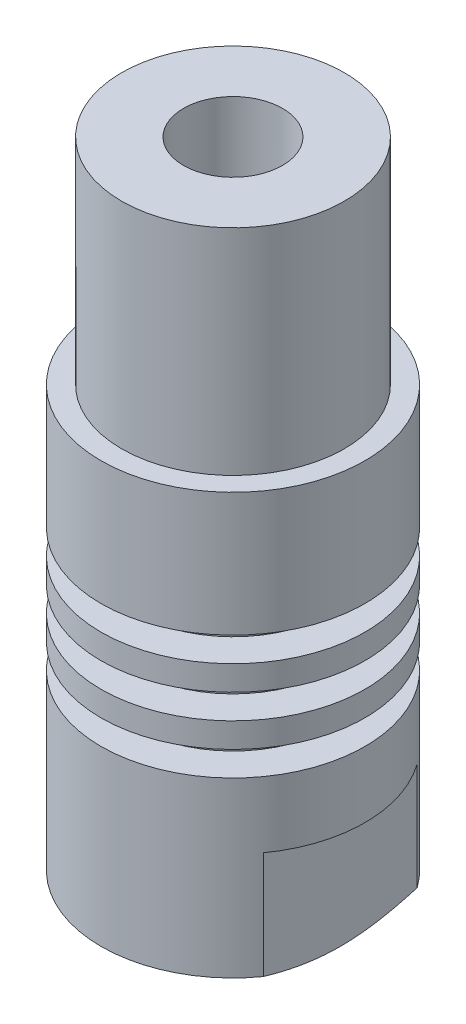
ISO-10303-21;
HEADER;
FILE_DESCRIPTION(('STEP AP214'),'2;1');
FILE_NAME('part.step','',(''),(''),'','','');
FILE_SCHEMA(('AUTOMOTIVE_DESIGN { 1 0 10303 214 1 1 1 1 }'));
ENDSEC;
DATA;
#1=APPLICATION_CONTEXT('core data for automotive mechanical design processes');
#2=APPLICATION_PROTOCOL_DEFINITION('international standard','automotive_design',2000,#1);
#3=PRODUCT_CONTEXT('',#1,'mechanical');
#4=PRODUCT('Part','Part','',(#3));
#5=PRODUCT_RELATED_PRODUCT_CATEGORY('part','',(#4));
#6=PRODUCT_DEFINITION_FORMATION('','',#4);
#7=PRODUCT_DEFINITION_CONTEXT('part definition',#1,'design');
#8=PRODUCT_DEFINITION('design','',#6,#7);
#9=PRODUCT_DEFINITION_SHAPE('','',#8);
#10=(LENGTH_UNIT() NAMED_UNIT(*) SI_UNIT(.MILLI.,.METRE.));
#11=(NAMED_UNIT(*) PLANE_ANGLE_UNIT() SI_UNIT($,.RADIAN.));
#12=(NAMED_UNIT(*) SI_UNIT($,.STERADIAN.) SOLID_ANGLE_UNIT());
#13=UNCERTAINTY_MEASURE_WITH_UNIT(LENGTH_MEASURE(1.E-05),#10,'distance_accuracy_value','');
#14=(GEOMETRIC_REPRESENTATION_CONTEXT(3) GLOBAL_UNCERTAINTY_ASSIGNED_CONTEXT((#13)) GLOBAL_UNIT_ASSIGNED_CONTEXT((#10,
#11,#12)) REPRESENTATION_CONTEXT('',''));
#15=CARTESIAN_POINT('',(0.,0.,0.));
#16=DIRECTION('',(0.,0.,1.));
#17=DIRECTION('',(1.,0.,0.));
#18=AXIS2_PLACEMENT_3D('',#15,#16,#17);
#19=CARTESIAN_POINT('',(0.,129.407380346339,0.));
#20=DIRECTION('',(0.,1.,0.));
#21=DIRECTION('',(0.,0.,1.));
#22=AXIS2_PLACEMENT_3D('',#19,#20,#21);
#23=CYLINDRICAL_SURFACE('',#22,7.99999999999999);
#24=CARTESIAN_POINT('',(0.,19.5,0.));
#25=DIRECTION('',(0.,1.,0.));
#26=DIRECTION('',(0.,0.,1.));
#27=AXIS2_PLACEMENT_3D('',#24,#25,#26);
#28=CIRCLE('',#27,8.);
#29=CARTESIAN_POINT('',(0.,19.5,8.));
#30=VERTEX_POINT('',#29);
#31=EDGE_CURVE('E406',#30,#30,#28,.T.);
#32=ORIENTED_EDGE('',*,*,#31,.T.);
#33=EDGE_LOOP('',(#32));
#34=FACE_BOUND('',#33,.T.);
#35=CARTESIAN_POINT('',(0.,27.,0.));
#36=DIRECTION('',(0.,1.,0.));
#37=DIRECTION('',(0.,0.,1.));
#38=AXIS2_PLACEMENT_3D('',#35,#36,#37);
#39=CIRCLE('',#38,7.99999999999999);
#40=CARTESIAN_POINT('',(0.,27.,7.99999999999999));
#41=VERTEX_POINT('',#40);
#42=EDGE_CURVE('E40',#41,#41,#39,.F.);
#43=ORIENTED_EDGE('',*,*,#42,.T.);
#44=EDGE_LOOP('',(#43));
#45=FACE_BOUND('',#44,.T.);
#46=ADVANCED_FACE('F36',(#34,#45),#23,.T.);
#47=CARTESIAN_POINT('',(-7.99999999999998,40.,0.));
#48=DIRECTION('',(0.,1.,0.));
#49=DIRECTION('',(0.,0.,1.));
#50=AXIS2_PLACEMENT_3D('',#47,#48,#49);
#51=PLANE('',#50);
#52=CARTESIAN_POINT('',(0.,40.,0.));
#53=DIRECTION('',(0.,1.,0.));
#54=DIRECTION('',(0.,0.,1.));
#55=AXIS2_PLACEMENT_3D('',#52,#53,#54);
#56=CIRCLE('',#55,3.);
#57=CARTESIAN_POINT('',(0.,40.,3.));
#58=VERTEX_POINT('',#57);
#59=EDGE_CURVE('E96',#58,#58,#56,.T.);
#60=ORIENTED_EDGE('',*,*,#59,.F.);
#61=EDGE_LOOP('',(#60));
#62=FACE_BOUND('',#61,.T.);
#63=CARTESIAN_POINT('',(0.,40.,0.));
#64=DIRECTION('',(0.,1.,0.));
#65=DIRECTION('',(0.,0.,1.));
#66=AXIS2_PLACEMENT_3D('',#63,#64,#65);
#67=CIRCLE('',#66,6.75);
#68=CARTESIAN_POINT('',(0.,40.,6.75));
#69=VERTEX_POINT('',#68);
#70=EDGE_CURVE('E245',#69,#69,#67,.T.);
#71=ORIENTED_EDGE('',*,*,#70,.T.);
#72=EDGE_LOOP('',(#71));
#73=FACE_BOUND('',#72,.T.);
#74=ADVANCED_FACE('F158',(#62,#73),#51,.T.);
#75=CARTESIAN_POINT('',(0.,1.5,0.));
#76=DIRECTION('',(0.,1.,0.));
#77=DIRECTION('',(0.,0.,1.));
#78=AXIS2_PLACEMENT_3D('',#75,#76,#77);
#79=CONICAL_SURFACE('',#78,7.99999999999999,1.10714871779409);
#80=CARTESIAN_POINT('',(0.,0.,0.));
#81=DIRECTION('',(0.,1.,0.));
#82=DIRECTION('',(0.,0.,1.));
#83=AXIS2_PLACEMENT_3D('',#80,#81,#82);
#84=CIRCLE('',#83,4.99999999999998);
#85=CARTESIAN_POINT('',(0.,0.,4.99999999999998));
#86=VERTEX_POINT('',#85);
#87=EDGE_CURVE('E12',#86,#86,#84,.T.);
#88=ORIENTED_EDGE('',*,*,#87,.T.);
#89=EDGE_LOOP('',(#88));
#90=FACE_BOUND('',#89,.T.);
#91=CARTESIAN_POINT('',(0.,1.5,0.));
#92=DIRECTION('',(0.,1.,0.));
#93=DIRECTION('',(0.,0.,1.));
#94=AXIS2_PLACEMENT_3D('',#91,#92,#93);
#95=CIRCLE('',#94,7.99999999999999);
#96=CARTESIAN_POINT('',(6.49999999999997,1.5,-4.66368952654442));
#97=VERTEX_POINT('',#96);
#98=CARTESIAN_POINT('',(-6.49999999999997,1.5,-4.66368952654442));
#99=VERTEX_POINT('',#98);
#100=EDGE_CURVE('E94',#97,#99,#95,.T.);
#101=ORIENTED_EDGE('',*,*,#100,.F.);
#102=CARTESIAN_POINT('',(6.49999999999999,4.63960517836139,-12.7140020611741));
#103=CARTESIAN_POINT('',(6.49999999999999,4.49493273691476,-12.3889791438294));
#104=CARTESIAN_POINT('',(6.49999999999999,4.35117750702607,-12.0635434352985));
#105=CARTESIAN_POINT('',(6.49999999999999,4.06600795170587,-11.4116234990025));
#106=CARTESIAN_POINT('',(6.49999999999999,3.92459377917146,-11.0851392044028));
#107=CARTESIAN_POINT('',(6.49999999999999,3.64433543055072,-10.4302489102803));
#108=CARTESIAN_POINT('',(6.49999999999999,3.50549732908588,-10.1018403056813));
#109=CARTESIAN_POINT('',(6.49999999999999,3.23142571950738,-9.44352872623451));
#110=CARTESIAN_POINT('',(6.49999999999999,3.09619212071106,-9.11362578922608));
#111=CARTESIAN_POINT('',(6.49999999999999,2.83048289305681,-8.45250376338199));
#112=CARTESIAN_POINT('',(6.49999999999999,2.70000014874712,-8.12128754257229));
#113=CARTESIAN_POINT('',(6.49999999999999,2.44483186701764,-7.45659634827721));
#114=CARTESIAN_POINT('',(6.49999999999999,2.32014667007343,-7.12312124344746));
#115=CARTESIAN_POINT('',(6.49999999999999,2.07840099908305,-6.45372644486896));
#116=CARTESIAN_POINT('',(6.49999999999999,1.96133416663675,-6.11780905674865));
#117=CARTESIAN_POINT('',(6.49999999999999,1.73702665581905,-5.44272397498847));
#118=CARTESIAN_POINT('',(6.49999999999999,1.62978438251793,-5.10355681882979));
#119=CARTESIAN_POINT('',(6.49999999999999,1.50145760944831,-4.66929022803816));
#120=CARTESIAN_POINT('',(6.49999999999999,1.47439812441263,-4.57594563698323));
#121=CARTESIAN_POINT('',(6.49999999999999,1.42132141191772,-4.38896083134469));
#122=CARTESIAN_POINT('',(6.49999999999999,1.39530416853117,-4.29532062130229));
#123=CARTESIAN_POINT('',(6.49999999999999,1.31884649816979,-4.01363447591895));
#124=CARTESIAN_POINT('',(6.49999999999999,1.27009239909997,-3.82513345071698));
#125=CARTESIAN_POINT('',(6.49999999999999,1.13144347216063,-3.25712110004858));
#126=CARTESIAN_POINT('',(6.49999999999999,1.04932049996449,-2.87562365996438));
#127=CARTESIAN_POINT('',(6.49999999999999,0.946261094020701,-2.29977813127616));
#128=CARTESIAN_POINT('',(6.49999999999999,0.915259699355964,-2.10720712065049));
#129=CARTESIAN_POINT('',(6.49999999999999,0.860714592579146,-1.7210183720728));
#130=CARTESIAN_POINT('',(6.49999999999999,0.837170046736164,-1.52740075360301));
#131=CARTESIAN_POINT('',(6.49999999999999,0.798232474629815,-1.13985753736791));
#132=CARTESIAN_POINT('',(6.49999999999999,0.78281812154265,-0.945934097286736));
#133=CARTESIAN_POINT('',(6.49999999999999,0.760510527948946,-0.557594838663115));
#134=CARTESIAN_POINT('',(6.49999999999999,0.753617189046767,-0.363179025832271));
#135=CARTESIAN_POINT('',(6.49999999999999,0.748572275423311,0.0257307608028582));
#136=CARTESIAN_POINT('',(6.49999999999999,0.750419038007415,0.220224712703199));
#137=CARTESIAN_POINT('',(6.49999999999999,0.76278940638265,0.608953775199544));
#138=CARTESIAN_POINT('',(6.49999999999999,0.773314033718197,0.803188852624818));
#139=CARTESIAN_POINT('',(6.49999999999999,0.806501889662758,1.24090602694894));
#140=CARTESIAN_POINT('',(6.49999999999999,0.831590920516132,1.48420561931385));
#141=CARTESIAN_POINT('',(6.49999999999999,0.893852125406738,1.96924724220696));
#142=CARTESIAN_POINT('',(6.49999999999999,0.931025317420885,2.21098913976373));
#143=CARTESIAN_POINT('',(6.49999999999999,1.01604103903786,2.69277716302994));
#144=CARTESIAN_POINT('',(6.49999999999999,1.06389244038228,2.93282170644527));
#145=CARTESIAN_POINT('',(6.49999999999999,1.16871694054054,3.41088019593747));
#146=CARTESIAN_POINT('',(6.49999999999999,1.22568964445531,3.64889422945387));
#147=CARTESIAN_POINT('',(6.49999999999999,1.34820588611418,4.1264246278799));
#148=CARTESIAN_POINT('',(6.49999999999999,1.41386316573231,4.36591159529887));
#149=CARTESIAN_POINT('',(6.49999999999999,1.55170831935892,4.84285142414976));
#150=CARTESIAN_POINT('',(6.49999999999999,1.62389277522808,5.08030527977033));
#151=CARTESIAN_POINT('',(6.49999999999999,1.77367698683179,5.55344813381403));
#152=CARTESIAN_POINT('',(6.49999999999999,1.85127585874315,5.78913741335531));
#153=CARTESIAN_POINT('',(6.49999999999999,2.01097599435672,6.2590172847031));
#154=CARTESIAN_POINT('',(6.49999999999999,2.09307790629008,6.49320765528824));
#155=CARTESIAN_POINT('',(6.49999999999999,2.28703034641471,7.03262988490792));
#156=CARTESIAN_POINT('',(6.49999999999999,2.40021373679549,7.33738166221177));
#157=CARTESIAN_POINT('',(6.49999999999999,2.63161506867892,7.94497276131788));
#158=CARTESIAN_POINT('',(6.49999999999999,2.74983321640616,8.24781200419785));
#159=CARTESIAN_POINT('',(6.49999999999999,2.99028703034095,8.8519169939098));
#160=CARTESIAN_POINT('',(6.49999999999999,3.11252303289466,9.15318260654962));
#161=CARTESIAN_POINT('',(6.49999999999999,3.36022795848007,9.75438363657073));
#162=CARTESIAN_POINT('',(6.49999999999999,3.4856969285348,10.0543190345298));
#163=CARTESIAN_POINT('',(6.49999999999999,3.8662108131295,10.9529295272112));
#164=CARTESIAN_POINT('',(6.49999999999999,4.12517530296346,11.5499439611486));
#165=CARTESIAN_POINT('',(6.49999999999999,4.65016432189855,12.7407935160942));
#166=CARTESIAN_POINT('',(6.49999999999999,4.91618837224115,13.334628849434));
#167=CARTESIAN_POINT('',(6.49999999999999,5.43683739745572,14.4837436524848));
#168=CARTESIAN_POINT('',(6.49999999999999,5.69116368566189,15.0391586745477));
#169=CARTESIAN_POINT('',(6.49999999999999,6.20312748367828,16.148471829484));
#170=CARTESIAN_POINT('',(6.49999999999999,6.46076506083453,16.7023699312269));
#171=CARTESIAN_POINT('',(6.49999999999999,6.97809934492668,17.8080180985776));
#172=CARTESIAN_POINT('',(6.49999999999999,7.23779164660991,18.3597702278274));
#173=CARTESIAN_POINT('',(6.49999999999999,7.75914833515714,19.4623190137403));
#174=CARTESIAN_POINT('',(6.49999999999999,8.02081265352454,20.0131157027799));
#175=CARTESIAN_POINT('',(6.49999999999999,8.28320577924075,20.5635626171586));
#176=B_SPLINE_CURVE_WITH_KNOTS('',3,(#102,#103,#104,#105,#106,#107,#108,#109,#110,#111,#112,
#113,#114,#115,#116,#117,#118,#119,#120,#121,#122,#123,#124,#125,#126,#127,#128,#129,#130,#131,
#132,#133,#134,#135,#136,#137,#138,#139,#140,#141,#142,#143,#144,#145,#146,#147,#148,#149,#150,
#151,#152,#153,#154,#155,#156,#157,#158,#159,#160,#161,#162,#163,#164,#165,#166,#167,#168,#169,
#170,#171,#172,#173,#174,#175),.UNSPECIFIED.,.F.,.F.,(4,2,2,2,2,2,2,2,2,2,2,2,2,2,2,2,2,2,2,2,2,
2,2,2,2,2,2,2,2,2,2,2,2,2,2,2,4),(0.,1.06730515758636,2.13467974924004,3.20431402837474,
4.27392137202762,5.34185467005331,6.40985060614333,7.47694343200912,8.54386271672926,
8.83542135077924,9.12697552758702,9.71105511301348,10.8808525348457,11.4658873460732,
12.0508567229673,12.6342839007031,13.2177043413035,13.8010137979488,14.3843919306593,
15.1178129637762,15.8512957967343,16.5853903108169,17.31945305149,18.0643130987016,
18.8087853133975,19.5531362870632,20.2975946957999,21.2728075860352,22.2480604596634,
23.2233951834841,24.1987441014193,26.1509456097113,28.1030150621006,29.9356240477088,
31.7682703646555,33.5977016553135,35.4270696921721),.UNSPECIFIED.);
#177=CARTESIAN_POINT('',(6.49999999999997,1.5,4.66368952654442));
#178=VERTEX_POINT('',#177);
#179=EDGE_CURVE('E79',#178,#97,#176,.F.);
#180=ORIENTED_EDGE('',*,*,#179,.F.);
#181=CARTESIAN_POINT('',(-6.49999999999997,1.5,4.66368952654442));
#182=VERTEX_POINT('',#181);
#183=EDGE_CURVE('E45',#182,#178,#95,.T.);
#184=ORIENTED_EDGE('',*,*,#183,.F.);
#185=CARTESIAN_POINT('',(-6.49999999999999,4.63960517836139,-12.7140020611741));
#186=CARTESIAN_POINT('',(-6.49999999999999,4.49493273691476,-12.3889791438294));
#187=CARTESIAN_POINT('',(-6.49999999999999,4.35117750702607,-12.0635434352985));
#188=CARTESIAN_POINT('',(-6.49999999999999,4.06600795170587,-11.4116234990025));
#189=CARTESIAN_POINT('',(-6.49999999999999,3.92459377917146,-11.0851392044028));
#190=CARTESIAN_POINT('',(-6.49999999999999,3.64433543055072,-10.4302489102803));
#191=CARTESIAN_POINT('',(-6.49999999999999,3.50549732908588,-10.1018403056813));
#192=CARTESIAN_POINT('',(-6.49999999999999,3.23142571950738,-9.44352872623451));
#193=CARTESIAN_POINT('',(-6.49999999999999,3.09619212071106,-9.11362578922608));
#194=CARTESIAN_POINT('',(-6.49999999999999,2.83048289305681,-8.45250376338199));
#195=CARTESIAN_POINT('',(-6.49999999999999,2.70000014874712,-8.12128754257229));
#196=CARTESIAN_POINT('',(-6.49999999999999,2.44483186701764,-7.45659634827721));
#197=CARTESIAN_POINT('',(-6.49999999999999,2.32014667007343,-7.12312124344746));
#198=CARTESIAN_POINT('',(-6.49999999999999,2.07840099908305,-6.45372644486896));
#199=CARTESIAN_POINT('',(-6.49999999999999,1.96133416663675,-6.11780905674865));
#200=CARTESIAN_POINT('',(-6.49999999999999,1.73702665581905,-5.44272397498847));
#201=CARTESIAN_POINT('',(-6.49999999999999,1.62978438251793,-5.10355681882979));
#202=CARTESIAN_POINT('',(-6.49999999999999,1.50145760944831,-4.66929022803816));
#203=CARTESIAN_POINT('',(-6.49999999999999,1.47439812441263,-4.57594563698323));
#204=CARTESIAN_POINT('',(-6.49999999999999,1.42132141191772,-4.38896083134469));
#205=CARTESIAN_POINT('',(-6.49999999999999,1.39530416853117,-4.29532062130229));
#206=CARTESIAN_POINT('',(-6.49999999999999,1.31884649816979,-4.01363447591895));
#207=CARTESIAN_POINT('',(-6.49999999999999,1.27009239909997,-3.82513345071698));
#208=CARTESIAN_POINT('',(-6.49999999999999,1.13144347216063,-3.25712110004858));
#209=CARTESIAN_POINT('',(-6.49999999999999,1.04932049996449,-2.87562365996438));
#210=CARTESIAN_POINT('',(-6.49999999999999,0.946261094020701,-2.29977813127616));
#211=CARTESIAN_POINT('',(-6.49999999999999,0.915259699355964,-2.10720712065049));
#212=CARTESIAN_POINT('',(-6.49999999999999,0.860714592579146,-1.7210183720728));
#213=CARTESIAN_POINT('',(-6.49999999999999,0.837170046736164,-1.52740075360301));
#214=CARTESIAN_POINT('',(-6.49999999999999,0.798232474629815,-1.13985753736791));
#215=CARTESIAN_POINT('',(-6.49999999999999,0.78281812154265,-0.945934097286736));
#216=CARTESIAN_POINT('',(-6.49999999999999,0.760510527948946,-0.557594838663115));
#217=CARTESIAN_POINT('',(-6.49999999999999,0.753617189046767,-0.363179025832271));
#218=CARTESIAN_POINT('',(-6.49999999999999,0.748572275423311,0.0257307608028582));
#219=CARTESIAN_POINT('',(-6.49999999999999,0.750419038007415,0.220224712703199));
#220=CARTESIAN_POINT('',(-6.49999999999999,0.76278940638265,0.608953775199544));
#221=CARTESIAN_POINT('',(-6.49999999999999,0.773314033718197,0.803188852624818));
#222=CARTESIAN_POINT('',(-6.49999999999999,0.806501889662758,1.24090602694894));
#223=CARTESIAN_POINT('',(-6.49999999999999,0.831590920516132,1.48420561931385));
#224=CARTESIAN_POINT('',(-6.49999999999999,0.893852125406738,1.96924724220696));
#225=CARTESIAN_POINT('',(-6.49999999999999,0.931025317420885,2.21098913976373));
#226=CARTESIAN_POINT('',(-6.49999999999999,1.01604103903786,2.69277716302994));
#227=CARTESIAN_POINT('',(-6.49999999999999,1.06389244038228,2.93282170644527));
#228=CARTESIAN_POINT('',(-6.49999999999999,1.16871694054054,3.41088019593747));
#229=CARTESIAN_POINT('',(-6.49999999999999,1.22568964445531,3.64889422945387));
#230=CARTESIAN_POINT('',(-6.49999999999999,1.34820588611418,4.1264246278799));
#231=CARTESIAN_POINT('',(-6.49999999999999,1.41386316573231,4.36591159529887));
#232=CARTESIAN_POINT('',(-6.49999999999999,1.55170831935892,4.84285142414976));
#233=CARTESIAN_POINT('',(-6.49999999999999,1.62389277522808,5.08030527977033));
#234=CARTESIAN_POINT('',(-6.49999999999999,1.77367698683179,5.55344813381403));
#235=CARTESIAN_POINT('',(-6.49999999999999,1.85127585874315,5.78913741335531));
#236=CARTESIAN_POINT('',(-6.49999999999999,2.01097599435672,6.2590172847031));
#237=CARTESIAN_POINT('',(-6.49999999999999,2.09307790629008,6.49320765528824));
#238=CARTESIAN_POINT('',(-6.49999999999999,2.28703034641471,7.03262988490792));
#239=CARTESIAN_POINT('',(-6.49999999999999,2.40021373679549,7.33738166221177));
#240=CARTESIAN_POINT('',(-6.49999999999999,2.63161506867892,7.94497276131788));
#241=CARTESIAN_POINT('',(-6.49999999999999,2.74983321640616,8.24781200419785));
#242=CARTESIAN_POINT('',(-6.49999999999999,2.99028703034095,8.8519169939098));
#243=CARTESIAN_POINT('',(-6.49999999999999,3.11252303289466,9.15318260654962));
#244=CARTESIAN_POINT('',(-6.49999999999999,3.36022795848007,9.75438363657073));
#245=CARTESIAN_POINT('',(-6.49999999999999,3.4856969285348,10.0543190345298));
#246=CARTESIAN_POINT('',(-6.49999999999999,3.8662108131295,10.9529295272112));
#247=CARTESIAN_POINT('',(-6.49999999999999,4.12517530296346,11.5499439611486));
#248=CARTESIAN_POINT('',(-6.49999999999999,4.65016432189855,12.7407935160942));
#249=CARTESIAN_POINT('',(-6.49999999999999,4.91618837224115,13.334628849434));
#250=CARTESIAN_POINT('',(-6.49999999999999,5.43683739745572,14.4837436524848));
#251=CARTESIAN_POINT('',(-6.49999999999999,5.69116368566189,15.0391586745477));
#252=CARTESIAN_POINT('',(-6.49999999999999,6.20312748367828,16.148471829484));
#253=CARTESIAN_POINT('',(-6.49999999999999,6.46076506083453,16.7023699312269));
#254=CARTESIAN_POINT('',(-6.49999999999999,6.97809934492668,17.8080180985776));
#255=CARTESIAN_POINT('',(-6.49999999999999,7.23779164660991,18.3597702278274));
#256=CARTESIAN_POINT('',(-6.49999999999999,7.75914833515714,19.4623190137403));
#257=CARTESIAN_POINT('',(-6.49999999999999,8.02081265352454,20.0131157027799));
#258=CARTESIAN_POINT('',(-6.49999999999999,8.28320577924075,20.5635626171586));
#259=B_SPLINE_CURVE_WITH_KNOTS('',3,(#185,#186,#187,#188,#189,#190,#191,#192,#193,#194,#195,
#196,#197,#198,#199,#200,#201,#202,#203,#204,#205,#206,#207,#208,#209,#210,#211,#212,#213,#214,
#215,#216,#217,#218,#219,#220,#221,#222,#223,#224,#225,#226,#227,#228,#229,#230,#231,#232,#233,
#234,#235,#236,#237,#238,#239,#240,#241,#242,#243,#244,#245,#246,#247,#248,#249,#250,#251,#252,
#253,#254,#255,#256,#257,#258),.UNSPECIFIED.,.F.,.F.,(4,2,2,2,2,2,2,2,2,2,2,2,2,2,2,2,2,2,2,2,2,
2,2,2,2,2,2,2,2,2,2,2,2,2,2,2,4),(0.,1.06730515758636,2.13467974924004,3.20431402837474,
4.27392137202762,5.34185467005331,6.40985060614333,7.47694343200912,8.54386271672926,
8.83542135077924,9.12697552758702,9.71105511301348,10.8808525348457,11.4658873460732,
12.0508567229673,12.6342839007031,13.2177043413035,13.8010137979488,14.3843919306593,
15.1178129637762,15.8512957967343,16.5853903108169,17.31945305149,18.0643130987016,
18.8087853133975,19.5531362870632,20.2975946957999,21.2728075860352,22.2480604596634,
23.2233951834841,24.1987441014193,26.1509456097113,28.1030150621006,29.9356240477088,
31.7682703646555,33.5977016553135,35.4270696921721),.UNSPECIFIED.);
#260=EDGE_CURVE('E100',#99,#182,#259,.T.);
#261=ORIENTED_EDGE('',*,*,#260,.F.);
#262=EDGE_LOOP('',(#101,#180,#184,#261));
#263=FACE_BOUND('',#262,.T.);
#264=ADVANCED_FACE('F99',(#90,#263),#79,.T.);
#265=CARTESIAN_POINT('',(0.,129.407380346339,0.));
#266=DIRECTION('',(0.,1.,0.));
#267=DIRECTION('',(0.,0.,1.));
#268=AXIS2_PLACEMENT_3D('',#265,#266,#267);
#269=CYLINDRICAL_SURFACE('',#268,7.99999999999999);
#270=CARTESIAN_POINT('',(0.,12.,0.));
#271=DIRECTION('',(0.,1.,0.));
#272=DIRECTION('',(0.,0.,1.));
#273=AXIS2_PLACEMENT_3D('',#270,#271,#272);
#274=CIRCLE('',#273,7.99999999999998);
#275=CARTESIAN_POINT('',(0.,12.,7.99999999999998));
#276=VERTEX_POINT('',#275);
#277=EDGE_CURVE('E101',#276,#276,#274,.T.);
#278=ORIENTED_EDGE('',*,*,#277,.F.);
#279=EDGE_LOOP('',(#278));
#280=FACE_BOUND('',#279,.T.);
#281=CARTESIAN_POINT('',(0.,7.99999999999999,0.));
#282=DIRECTION('',(0.,-1.,0.));
#283=DIRECTION('',(0.,0.,-1.));
#284=AXIS2_PLACEMENT_3D('',#281,#282,#283);
#285=CIRCLE('',#284,7.99999999999999);
#286=CARTESIAN_POINT('',(6.49999999999999,7.99999999999999,-4.6636895265444));
#287=VERTEX_POINT('',#286);
#288=CARTESIAN_POINT('',(6.49999999999997,7.99999999999999,4.66368952654442));
#289=VERTEX_POINT('',#288);
#290=EDGE_CURVE('E52',#287,#289,#285,.T.);
#291=ORIENTED_EDGE('',*,*,#290,.F.);
#292=DIRECTION('',(0.,1.,0.));
#293=VECTOR('',#292,1.);
#294=CARTESIAN_POINT('',(6.49999999999997,129.407380346339,-4.66368952654442));
#295=LINE('',#294,#293);
#296=EDGE_CURVE('E82',#287,#97,#295,.F.);
#297=ORIENTED_EDGE('',*,*,#296,.T.);
#298=ORIENTED_EDGE('',*,*,#100,.T.);
#299=DIRECTION('',(0.,1.,0.));
#300=VECTOR('',#299,1.);
#301=CARTESIAN_POINT('',(-6.49999999999997,129.407380346339,-4.66368952654442));
#302=LINE('',#301,#300);
#303=CARTESIAN_POINT('',(-6.49999999999999,7.99999999999999,-4.6636895265444));
#304=VERTEX_POINT('',#303);
#305=EDGE_CURVE('E405',#99,#304,#302,.T.);
#306=ORIENTED_EDGE('',*,*,#305,.T.);
#307=CARTESIAN_POINT('',(0.,7.99999999999998,0.));
#308=DIRECTION('',(0.,-1.,0.));
#309=DIRECTION('',(1.,0.,0.));
#310=AXIS2_PLACEMENT_3D('',#307,#308,#309);
#311=CIRCLE('',#310,7.99999999999999);
#312=CARTESIAN_POINT('',(-6.49999999999999,7.99999999999999,4.6636895265444));
#313=VERTEX_POINT('',#312);
#314=EDGE_CURVE('E404',#313,#304,#311,.T.);
#315=ORIENTED_EDGE('',*,*,#314,.F.);
#316=DIRECTION('',(0.,1.,0.));
#317=VECTOR('',#316,1.);
#318=CARTESIAN_POINT('',(-6.49999999999997,129.407380346339,4.66368952654442));
#319=LINE('',#318,#317);
#320=EDGE_CURVE('E60',#182,#313,#319,.T.);
#321=ORIENTED_EDGE('',*,*,#320,.F.);
#322=ORIENTED_EDGE('',*,*,#183,.T.);
#323=DIRECTION('',(0.,1.,0.));
#324=VECTOR('',#323,1.);
#325=CARTESIAN_POINT('',(6.49999999999997,129.407380346339,4.66368952654442));
#326=LINE('',#325,#324);
#327=EDGE_CURVE('E84',#289,#178,#326,.F.);
#328=ORIENTED_EDGE('',*,*,#327,.F.);
#329=EDGE_LOOP('',(#291,#297,#298,#306,#315,#321,#322,#328));
#330=FACE_BOUND('',#329,.T.);
#331=ADVANCED_FACE('F92',(#280,#330),#269,.T.);
#332=CARTESIAN_POINT('',(0.,0.,0.));
#333=DIRECTION('',(0.,-1.,0.));
#334=DIRECTION('',(0.,0.,-1.));
#335=AXIS2_PLACEMENT_3D('',#332,#333,#334);
#336=PLANE('',#335);
#337=CARTESIAN_POINT('',(0.,0.,0.));
#338=DIRECTION('',(0.,-1.,0.));
#339=DIRECTION('',(0.,0.,-1.));
#340=AXIS2_PLACEMENT_3D('',#337,#338,#339);
#341=CIRCLE('',#340,3.39999999999999);
#342=CARTESIAN_POINT('',(0.,0.,-3.39999999999999));
#343=VERTEX_POINT('',#342);
#344=EDGE_CURVE('E115',#343,#343,#341,.T.);
#345=ORIENTED_EDGE('',*,*,#344,.F.);
#346=EDGE_LOOP('',(#345));
#347=FACE_BOUND('',#346,.T.);
#348=ORIENTED_EDGE('',*,*,#87,.F.);
#349=EDGE_LOOP('',(#348));
#350=FACE_BOUND('',#349,.T.);
#351=ADVANCED_FACE('F38',(#347,#350),#336,.T.);
#352=CARTESIAN_POINT('',(-7.99999999999998,12.,0.));
#353=DIRECTION('',(0.,1.,0.));
#354=DIRECTION('',(0.,0.,1.));
#355=AXIS2_PLACEMENT_3D('',#352,#353,#354);
#356=PLANE('',#355);
#357=ORIENTED_EDGE('',*,*,#277,.T.);
#358=EDGE_LOOP('',(#357));
#359=FACE_BOUND('',#358,.T.);
#360=CARTESIAN_POINT('',(0.,12.,0.));
#361=DIRECTION('',(0.,1.,0.));
#362=DIRECTION('',(0.,0.,1.));
#363=AXIS2_PLACEMENT_3D('',#360,#361,#362);
#364=CIRCLE('',#363,5.99999999999999);
#365=CARTESIAN_POINT('',(0.,12.,5.99999999999999));
#366=VERTEX_POINT('',#365);
#367=EDGE_CURVE('E104',#366,#366,#364,.T.);
#368=ORIENTED_EDGE('',*,*,#367,.F.);
#369=EDGE_LOOP('',(#368));
#370=FACE_BOUND('',#369,.T.);
#371=ADVANCED_FACE('F203',(#359,#370),#356,.T.);
#372=CARTESIAN_POINT('',(0.,129.407380346339,0.));
#373=DIRECTION('',(0.,1.,0.));
#374=DIRECTION('',(0.,0.,1.));
#375=AXIS2_PLACEMENT_3D('',#372,#373,#374);
#376=CYLINDRICAL_SURFACE('',#375,5.99999999999999);
#377=ORIENTED_EDGE('',*,*,#367,.T.);
#378=EDGE_LOOP('',(#377));
#379=FACE_BOUND('',#378,.T.);
#380=CARTESIAN_POINT('',(0.,13.5,0.));
#381=DIRECTION('',(0.,1.,0.));
#382=DIRECTION('',(0.,0.,1.));
#383=AXIS2_PLACEMENT_3D('',#380,#381,#382);
#384=CIRCLE('',#383,5.99999999999999);
#385=CARTESIAN_POINT('',(0.,13.5,5.99999999999999));
#386=VERTEX_POINT('',#385);
#387=EDGE_CURVE('E434',#386,#386,#384,.T.);
#388=ORIENTED_EDGE('',*,*,#387,.F.);
#389=EDGE_LOOP('',(#388));
#390=FACE_BOUND('',#389,.T.);
#391=ADVANCED_FACE('F199',(#379,#390),#376,.T.);
#392=CARTESIAN_POINT('',(-5.99999999999999,13.5,0.));
#393=DIRECTION('',(0.,-1.,0.));
#394=DIRECTION('',(0.,0.,-1.));
#395=AXIS2_PLACEMENT_3D('',#392,#393,#394);
#396=PLANE('',#395);
#397=ORIENTED_EDGE('',*,*,#387,.T.);
#398=EDGE_LOOP('',(#397));
#399=FACE_BOUND('',#398,.T.);
#400=CARTESIAN_POINT('',(0.,13.5,0.));
#401=DIRECTION('',(0.,1.,0.));
#402=DIRECTION('',(0.,0.,1.));
#403=AXIS2_PLACEMENT_3D('',#400,#401,#402);
#404=CIRCLE('',#403,8.);
#405=CARTESIAN_POINT('',(0.,13.5,8.));
#406=VERTEX_POINT('',#405);
#407=EDGE_CURVE('E431',#406,#406,#404,.T.);
#408=ORIENTED_EDGE('',*,*,#407,.F.);
#409=EDGE_LOOP('',(#408));
#410=FACE_BOUND('',#409,.T.);
#411=ADVANCED_FACE('F195',(#399,#410),#396,.T.);
#412=CARTESIAN_POINT('',(0.,129.407380346339,0.));
#413=DIRECTION('',(0.,1.,0.));
#414=DIRECTION('',(0.,0.,1.));
#415=AXIS2_PLACEMENT_3D('',#412,#413,#414);
#416=CYLINDRICAL_SURFACE('',#415,8.);
#417=ORIENTED_EDGE('',*,*,#407,.T.);
#418=EDGE_LOOP('',(#417));
#419=FACE_BOUND('',#418,.T.);
#420=CARTESIAN_POINT('',(0.,15.,0.));
#421=DIRECTION('',(0.,1.,0.));
#422=DIRECTION('',(0.,0.,1.));
#423=AXIS2_PLACEMENT_3D('',#420,#421,#422);
#424=CIRCLE('',#423,8.);
#425=CARTESIAN_POINT('',(0.,15.,8.));
#426=VERTEX_POINT('',#425);
#427=EDGE_CURVE('E428',#426,#426,#424,.T.);
#428=ORIENTED_EDGE('',*,*,#427,.F.);
#429=EDGE_LOOP('',(#428));
#430=FACE_BOUND('',#429,.T.);
#431=ADVANCED_FACE('F191',(#419,#430),#416,.T.);
#432=CARTESIAN_POINT('',(-8.,15.,0.));
#433=DIRECTION('',(0.,1.,0.));
#434=DIRECTION('',(0.,0.,1.));
#435=AXIS2_PLACEMENT_3D('',#432,#433,#434);
#436=PLANE('',#435);
#437=ORIENTED_EDGE('',*,*,#427,.T.);
#438=EDGE_LOOP('',(#437));
#439=FACE_BOUND('',#438,.T.);
#440=CARTESIAN_POINT('',(0.,15.,0.));
#441=DIRECTION('',(0.,1.,0.));
#442=DIRECTION('',(0.,0.,1.));
#443=AXIS2_PLACEMENT_3D('',#440,#441,#442);
#444=CIRCLE('',#443,6.);
#445=CARTESIAN_POINT('',(0.,15.,6.));
#446=VERTEX_POINT('',#445);
#447=EDGE_CURVE('E425',#446,#446,#444,.T.);
#448=ORIENTED_EDGE('',*,*,#447,.F.);
#449=EDGE_LOOP('',(#448));
#450=FACE_BOUND('',#449,.T.);
#451=ADVANCED_FACE('F187',(#439,#450),#436,.T.);
#452=CARTESIAN_POINT('',(0.,129.407380346339,0.));
#453=DIRECTION('',(0.,1.,0.));
#454=DIRECTION('',(0.,0.,1.));
#455=AXIS2_PLACEMENT_3D('',#452,#453,#454);
#456=CYLINDRICAL_SURFACE('',#455,6.);
#457=ORIENTED_EDGE('',*,*,#447,.T.);
#458=EDGE_LOOP('',(#457));
#459=FACE_BOUND('',#458,.T.);
#460=CARTESIAN_POINT('',(0.,16.5,0.));
#461=DIRECTION('',(0.,1.,0.));
#462=DIRECTION('',(0.,0.,1.));
#463=AXIS2_PLACEMENT_3D('',#460,#461,#462);
#464=CIRCLE('',#463,6.);
#465=CARTESIAN_POINT('',(0.,16.5,6.));
#466=VERTEX_POINT('',#465);
#467=EDGE_CURVE('E422',#466,#466,#464,.T.);
#468=ORIENTED_EDGE('',*,*,#467,.F.);
#469=EDGE_LOOP('',(#468));
#470=FACE_BOUND('',#469,.T.);
#471=ADVANCED_FACE('F183',(#459,#470),#456,.T.);
#472=CARTESIAN_POINT('',(-6.,16.5,0.));
#473=DIRECTION('',(0.,-1.,0.));
#474=DIRECTION('',(0.,0.,-1.));
#475=AXIS2_PLACEMENT_3D('',#472,#473,#474);
#476=PLANE('',#475);
#477=ORIENTED_EDGE('',*,*,#467,.T.);
#478=EDGE_LOOP('',(#477));
#479=FACE_BOUND('',#478,.T.);
#480=CARTESIAN_POINT('',(0.,16.5,0.));
#481=DIRECTION('',(0.,1.,0.));
#482=DIRECTION('',(0.,0.,1.));
#483=AXIS2_PLACEMENT_3D('',#480,#481,#482);
#484=CIRCLE('',#483,8.);
#485=CARTESIAN_POINT('',(0.,16.5,8.));
#486=VERTEX_POINT('',#485);
#487=EDGE_CURVE('E419',#486,#486,#484,.T.);
#488=ORIENTED_EDGE('',*,*,#487,.F.);
#489=EDGE_LOOP('',(#488));
#490=FACE_BOUND('',#489,.T.);
#491=ADVANCED_FACE('F179',(#479,#490),#476,.T.);
#492=CARTESIAN_POINT('',(0.,129.407380346339,0.));
#493=DIRECTION('',(0.,1.,0.));
#494=DIRECTION('',(0.,0.,1.));
#495=AXIS2_PLACEMENT_3D('',#492,#493,#494);
#496=CYLINDRICAL_SURFACE('',#495,8.);
#497=ORIENTED_EDGE('',*,*,#487,.T.);
#498=EDGE_LOOP('',(#497));
#499=FACE_BOUND('',#498,.T.);
#500=CARTESIAN_POINT('',(0.,18.,0.));
#501=DIRECTION('',(0.,1.,0.));
#502=DIRECTION('',(0.,0.,1.));
#503=AXIS2_PLACEMENT_3D('',#500,#501,#502);
#504=CIRCLE('',#503,8.);
#505=CARTESIAN_POINT('',(0.,18.,8.));
#506=VERTEX_POINT('',#505);
#507=EDGE_CURVE('E416',#506,#506,#504,.T.);
#508=ORIENTED_EDGE('',*,*,#507,.F.);
#509=EDGE_LOOP('',(#508));
#510=FACE_BOUND('',#509,.T.);
#511=ADVANCED_FACE('F175',(#499,#510),#496,.T.);
#512=CARTESIAN_POINT('',(-8.,18.,0.));
#513=DIRECTION('',(0.,1.,0.));
#514=DIRECTION('',(0.,0.,1.));
#515=AXIS2_PLACEMENT_3D('',#512,#513,#514);
#516=PLANE('',#515);
#517=ORIENTED_EDGE('',*,*,#507,.T.);
#518=EDGE_LOOP('',(#517));
#519=FACE_BOUND('',#518,.T.);
#520=CARTESIAN_POINT('',(0.,18.,0.));
#521=DIRECTION('',(0.,1.,0.));
#522=DIRECTION('',(0.,0.,1.));
#523=AXIS2_PLACEMENT_3D('',#520,#521,#522);
#524=CIRCLE('',#523,6.);
#525=CARTESIAN_POINT('',(0.,18.,6.));
#526=VERTEX_POINT('',#525);
#527=EDGE_CURVE('E411',#526,#526,#524,.T.);
#528=ORIENTED_EDGE('',*,*,#527,.F.);
#529=EDGE_LOOP('',(#528));
#530=FACE_BOUND('',#529,.T.);
#531=ADVANCED_FACE('F171',(#519,#530),#516,.T.);
#532=CARTESIAN_POINT('',(0.,129.407380346339,0.));
#533=DIRECTION('',(0.,1.,0.));
#534=DIRECTION('',(0.,0.,1.));
#535=AXIS2_PLACEMENT_3D('',#532,#533,#534);
#536=CYLINDRICAL_SURFACE('',#535,6.);
#537=ORIENTED_EDGE('',*,*,#527,.T.);
#538=EDGE_LOOP('',(#537));
#539=FACE_BOUND('',#538,.T.);
#540=CARTESIAN_POINT('',(0.,19.5,0.));
#541=DIRECTION('',(0.,1.,0.));
#542=DIRECTION('',(0.,0.,1.));
#543=AXIS2_PLACEMENT_3D('',#540,#541,#542);
#544=CIRCLE('',#543,6.);
#545=CARTESIAN_POINT('',(0.,19.5,6.));
#546=VERTEX_POINT('',#545);
#547=EDGE_CURVE('E408',#546,#546,#544,.T.);
#548=ORIENTED_EDGE('',*,*,#547,.F.);
#549=EDGE_LOOP('',(#548));
#550=FACE_BOUND('',#549,.T.);
#551=ADVANCED_FACE('F167',(#539,#550),#536,.T.);
#552=CARTESIAN_POINT('',(-6.,19.5,0.));
#553=DIRECTION('',(0.,-1.,0.));
#554=DIRECTION('',(0.,0.,-1.));
#555=AXIS2_PLACEMENT_3D('',#552,#553,#554);
#556=PLANE('',#555);
#557=ORIENTED_EDGE('',*,*,#547,.T.);
#558=EDGE_LOOP('',(#557));
#559=FACE_BOUND('',#558,.T.);
#560=ORIENTED_EDGE('',*,*,#31,.F.);
#561=EDGE_LOOP('',(#560));
#562=FACE_BOUND('',#561,.T.);
#563=ADVANCED_FACE('F157',(#559,#562),#556,.T.);
#564=CARTESIAN_POINT('',(-6.49999999999999,7.99999999999999,8.001));
#565=DIRECTION('',(-1.,0.,0.));
#566=DIRECTION('',(0.,-1.,0.));
#567=AXIS2_PLACEMENT_3D('',#564,#565,#566);
#568=PLANE('',#567);
#569=ORIENTED_EDGE('',*,*,#260,.T.);
#570=ORIENTED_EDGE('',*,*,#320,.T.);
#571=DIRECTION('',(0.,0.,-1.));
#572=VECTOR('',#571,1.);
#573=CARTESIAN_POINT('',(-6.49999999999999,7.99999999999999,8.001));
#574=LINE('',#573,#572);
#575=EDGE_CURVE('E150',#313,#304,#574,.T.);
#576=ORIENTED_EDGE('',*,*,#575,.T.);
#577=ORIENTED_EDGE('',*,*,#305,.F.);
#578=EDGE_LOOP('',(#569,#570,#576,#577));
#579=FACE_BOUND('',#578,.T.);
#580=ADVANCED_FACE('F153',(#579),#568,.T.);
#581=CARTESIAN_POINT('',(-7.99999999999999,7.99999999999999,8.001));
#582=DIRECTION('',(0.,-1.,0.));
#583=DIRECTION('',(1.,0.,0.));
#584=AXIS2_PLACEMENT_3D('',#581,#582,#583);
#585=PLANE('',#584);
#586=ORIENTED_EDGE('',*,*,#314,.T.);
#587=ORIENTED_EDGE('',*,*,#575,.F.);
#588=EDGE_LOOP('',(#586,#587));
#589=FACE_BOUND('',#588,.T.);
#590=ADVANCED_FACE('F140',(#589),#585,.T.);
#591=CARTESIAN_POINT('',(7.99999999999999,7.99999999999999,8.001));
#592=DIRECTION('',(0.,-1.,0.));
#593=DIRECTION('',(0.,0.,-1.));
#594=AXIS2_PLACEMENT_3D('',#591,#592,#593);
#595=PLANE('',#594);
#596=ORIENTED_EDGE('',*,*,#290,.T.);
#597=DIRECTION('',(0.,0.,-1.));
#598=VECTOR('',#597,1.);
#599=CARTESIAN_POINT('',(6.49999999999999,7.99999999999999,8.001));
#600=LINE('',#599,#598);
#601=EDGE_CURVE('E89',#289,#287,#600,.T.);
#602=ORIENTED_EDGE('',*,*,#601,.T.);
#603=EDGE_LOOP('',(#596,#602));
#604=FACE_BOUND('',#603,.T.);
#605=ADVANCED_FACE('F137',(#604),#595,.T.);
#606=CARTESIAN_POINT('',(6.49999999999999,7.99999999999999,8.001));
#607=DIRECTION('',(1.,0.,0.));
#608=DIRECTION('',(0.,1.,0.));
#609=AXIS2_PLACEMENT_3D('',#606,#607,#608);
#610=PLANE('',#609);
#611=ORIENTED_EDGE('',*,*,#179,.T.);
#612=ORIENTED_EDGE('',*,*,#296,.F.);
#613=ORIENTED_EDGE('',*,*,#601,.F.);
#614=ORIENTED_EDGE('',*,*,#327,.T.);
#615=EDGE_LOOP('',(#611,#612,#613,#614));
#616=FACE_BOUND('',#615,.T.);
#617=ADVANCED_FACE('F81',(#616),#610,.T.);
#618=CARTESIAN_POINT('',(0.,0.,0.));
#619=DIRECTION('',(0.,1.,0.));
#620=DIRECTION('',(0.,0.,1.));
#621=AXIS2_PLACEMENT_3D('',#618,#619,#620);
#622=CYLINDRICAL_SURFACE('',#621,3.);
#623=CARTESIAN_POINT('',(0.,12.240344247611,0.));
#624=DIRECTION('',(0.,-1.,0.));
#625=DIRECTION('',(0.,0.,-1.));
#626=AXIS2_PLACEMENT_3D('',#623,#624,#625);
#627=CIRCLE('',#626,3.);
#628=CARTESIAN_POINT('',(0.,12.240344247611,-3.));
#629=VERTEX_POINT('',#628);
#630=EDGE_CURVE('E107',#629,#629,#627,.T.);
#631=ORIENTED_EDGE('',*,*,#630,.T.);
#632=EDGE_LOOP('',(#631));
#633=FACE_BOUND('',#632,.T.);
#634=ORIENTED_EDGE('',*,*,#59,.T.);
#635=EDGE_LOOP('',(#634));
#636=FACE_BOUND('',#635,.T.);
#637=ADVANCED_FACE('F136',(#633,#636),#622,.F.);
#638=CARTESIAN_POINT('',(0.,12.,0.));
#639=DIRECTION('',(0.,-1.,0.));
#640=DIRECTION('',(0.,0.,-1.));
#641=AXIS2_PLACEMENT_3D('',#638,#639,#640);
#642=CONICAL_SURFACE('',#641,3.4,1.02974425867665);
#643=CARTESIAN_POINT('',(0.,12.,0.));
#644=DIRECTION('',(0.,-1.,0.));
#645=DIRECTION('',(0.,0.,-1.));
#646=AXIS2_PLACEMENT_3D('',#643,#644,#645);
#647=CIRCLE('',#646,3.4);
#648=CARTESIAN_POINT('',(0.,12.,-3.4));
#649=VERTEX_POINT('',#648);
#650=EDGE_CURVE('E109',#649,#649,#647,.T.);
#651=ORIENTED_EDGE('',*,*,#650,.T.);
#652=EDGE_LOOP('',(#651));
#653=FACE_BOUND('',#652,.T.);
#654=ORIENTED_EDGE('',*,*,#630,.F.);
#655=EDGE_LOOP('',(#654));
#656=FACE_BOUND('',#655,.T.);
#657=ADVANCED_FACE('F225',(#653,#656),#642,.F.);
#658=CARTESIAN_POINT('',(0.,0.,0.));
#659=DIRECTION('',(0.,-1.,0.));
#660=DIRECTION('',(0.,0.,-1.));
#661=AXIS2_PLACEMENT_3D('',#658,#659,#660);
#662=CYLINDRICAL_SURFACE('',#661,3.39999999999999);
#663=ORIENTED_EDGE('',*,*,#650,.F.);
#664=EDGE_LOOP('',(#663));
#665=FACE_BOUND('',#664,.T.);
#666=ORIENTED_EDGE('',*,*,#344,.T.);
#667=EDGE_LOOP('',(#666));
#668=FACE_BOUND('',#667,.T.);
#669=ADVANCED_FACE('F222',(#665,#668),#662,.F.);
#670=CARTESIAN_POINT('',(0.,27.,0.));
#671=DIRECTION('',(0.,1.,0.));
#672=DIRECTION('',(0.,0.,1.));
#673=AXIS2_PLACEMENT_3D('',#670,#671,#672);
#674=PLANE('',#673);
#675=ORIENTED_EDGE('',*,*,#42,.F.);
#676=EDGE_LOOP('',(#675));
#677=FACE_BOUND('',#676,.T.);
#678=CARTESIAN_POINT('',(0.,27.,0.));
#679=DIRECTION('',(0.,1.,0.));
#680=DIRECTION('',(0.,0.,1.));
#681=AXIS2_PLACEMENT_3D('',#678,#679,#680);
#682=CIRCLE('',#681,6.75);
#683=CARTESIAN_POINT('',(0.,27.,6.75));
#684=VERTEX_POINT('',#683);
#685=EDGE_CURVE('E247',#684,#684,#682,.T.);
#686=ORIENTED_EDGE('',*,*,#685,.F.);
#687=EDGE_LOOP('',(#686));
#688=FACE_BOUND('',#687,.T.);
#689=ADVANCED_FACE('F224',(#677,#688),#674,.T.);
#690=CARTESIAN_POINT('',(0.,27.,0.));
#691=DIRECTION('',(0.,1.,0.));
#692=DIRECTION('',(0.,0.,1.));
#693=AXIS2_PLACEMENT_3D('',#690,#691,#692);
#694=CYLINDRICAL_SURFACE('',#693,6.75);
#695=ORIENTED_EDGE('',*,*,#685,.T.);
#696=EDGE_LOOP('',(#695));
#697=FACE_BOUND('',#696,.T.);
#698=ORIENTED_EDGE('',*,*,#70,.F.);
#699=EDGE_LOOP('',(#698));
#700=FACE_BOUND('',#699,.T.);
#701=ADVANCED_FACE('F232',(#697,#700),#694,.T.);
#702=CLOSED_SHELL('',(#46,#74,#264,#331,#351,#371,#391,#411,#431,#451,#471,#491,#511,#531,#551,
#563,#580,#590,#605,#617,#637,#657,#669,#689,#701));
#703=MANIFOLD_SOLID_BREP('B2',#702);
#704=ADVANCED_BREP_SHAPE_REPRESENTATION('',(#18,#703),#14);
#705=SHAPE_DEFINITION_REPRESENTATION(#9,#704);
ENDSEC;
END-ISO-10303-21;
